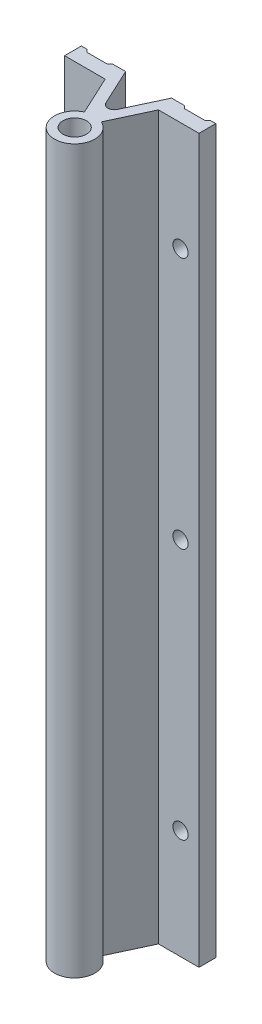
ISO-10303-21;
HEADER;
FILE_DESCRIPTION(('STEP AP214'),'2;1');
FILE_NAME('part.step','',(''),(''),'','','');
FILE_SCHEMA(('AUTOMOTIVE_DESIGN { 1 0 10303 214 1 1 1 1 }'));
ENDSEC;
DATA;
#1=APPLICATION_CONTEXT('core data for automotive mechanical design processes');
#2=APPLICATION_PROTOCOL_DEFINITION('international standard','automotive_design',2000,#1);
#3=PRODUCT_CONTEXT('',#1,'mechanical');
#4=PRODUCT('Part','Part','',(#3));
#5=PRODUCT_RELATED_PRODUCT_CATEGORY('part','',(#4));
#6=PRODUCT_DEFINITION_FORMATION('','',#4);
#7=PRODUCT_DEFINITION_CONTEXT('part definition',#1,'design');
#8=PRODUCT_DEFINITION('design','',#6,#7);
#9=PRODUCT_DEFINITION_SHAPE('','',#8);
#10=(LENGTH_UNIT() NAMED_UNIT(*) SI_UNIT(.MILLI.,.METRE.));
#11=(NAMED_UNIT(*) PLANE_ANGLE_UNIT() SI_UNIT($,.RADIAN.));
#12=(NAMED_UNIT(*) SI_UNIT($,.STERADIAN.) SOLID_ANGLE_UNIT());
#13=UNCERTAINTY_MEASURE_WITH_UNIT(LENGTH_MEASURE(1.E-05),#10,'distance_accuracy_value','');
#14=(GEOMETRIC_REPRESENTATION_CONTEXT(3) GLOBAL_UNCERTAINTY_ASSIGNED_CONTEXT((#13)) GLOBAL_UNIT_ASSIGNED_CONTEXT((#10,
#11,#12)) REPRESENTATION_CONTEXT('',''));
#15=CARTESIAN_POINT('',(0.,0.,0.));
#16=DIRECTION('',(0.,0.,1.));
#17=DIRECTION('',(1.,0.,0.));
#18=AXIS2_PLACEMENT_3D('',#15,#16,#17);
#19=CARTESIAN_POINT('',(-20.,0.,-22.));
#20=DIRECTION('',(0.,0.,-1.));
#21=DIRECTION('',(1.,0.,0.));
#22=AXIS2_PLACEMENT_3D('',#19,#20,#21);
#23=PLANE('',#22);
#24=DIRECTION('',(0.,-1.,0.));
#25=VECTOR('',#24,1.);
#26=CARTESIAN_POINT('',(-20.,-107.5,-22.));
#27=LINE('',#26,#25);
#28=CARTESIAN_POINT('',(-20.,0.,-22.));
#29=VERTEX_POINT('',#28);
#30=CARTESIAN_POINT('',(-20.,-215.,-22.));
#31=VERTEX_POINT('',#30);
#32=EDGE_CURVE('E358',#29,#31,#27,.T.);
#33=ORIENTED_EDGE('',*,*,#32,.F.);
#34=DIRECTION('',(1.,0.,0.));
#35=VECTOR('',#34,1.);
#36=CARTESIAN_POINT('',(-19.175,0.,-22.));
#37=LINE('',#36,#35);
#38=CARTESIAN_POINT('',(-18.35,0.,-22.));
#39=VERTEX_POINT('',#38);
#40=EDGE_CURVE('E291',#29,#39,#37,.T.);
#41=ORIENTED_EDGE('',*,*,#40,.T.);
#42=DIRECTION('',(0.,1.,0.));
#43=VECTOR('',#42,1.);
#44=CARTESIAN_POINT('',(-18.35,-107.5,-22.));
#45=LINE('',#44,#43);
#46=CARTESIAN_POINT('',(-18.35,-215.,-22.));
#47=VERTEX_POINT('',#46);
#48=EDGE_CURVE('E332',#47,#39,#45,.T.);
#49=ORIENTED_EDGE('',*,*,#48,.F.);
#50=DIRECTION('',(-1.,0.,0.));
#51=VECTOR('',#50,1.);
#52=CARTESIAN_POINT('',(-19.175,-215.,-22.));
#53=LINE('',#52,#51);
#54=EDGE_CURVE('E294',#47,#31,#53,.T.);
#55=ORIENTED_EDGE('',*,*,#54,.T.);
#56=EDGE_LOOP('',(#33,#41,#49,#55));
#57=FACE_BOUND('',#56,.T.);
#58=ADVANCED_FACE('F16',(#57),#23,.T.);
#59=CARTESIAN_POINT('',(-18.35,0.,-22.));
#60=DIRECTION('',(0.707106781186546,0.,-0.707106781186549));
#61=DIRECTION('',(0.707106781186549,0.,0.707106781186546));
#62=AXIS2_PLACEMENT_3D('',#59,#60,#61);
#63=PLANE('',#62);
#64=DIRECTION('',(0.707106781186549,0.,0.707106781186546));
#65=VECTOR('',#64,1.);
#66=CARTESIAN_POINT('',(-17.95,0.,-21.6));
#67=LINE('',#66,#65);
#68=CARTESIAN_POINT('',(-17.55,0.,-21.2));
#69=VERTEX_POINT('',#68);
#70=EDGE_CURVE('E289',#39,#69,#67,.T.);
#71=ORIENTED_EDGE('',*,*,#70,.T.);
#72=DIRECTION('',(0.,1.,0.));
#73=VECTOR('',#72,1.);
#74=CARTESIAN_POINT('',(-17.55,-107.5,-21.2));
#75=LINE('',#74,#73);
#76=CARTESIAN_POINT('',(-17.55,-215.,-21.2));
#77=VERTEX_POINT('',#76);
#78=EDGE_CURVE('E323',#77,#69,#75,.T.);
#79=ORIENTED_EDGE('',*,*,#78,.F.);
#80=DIRECTION('',(-0.707106781186549,0.,-0.707106781186546));
#81=VECTOR('',#80,1.);
#82=CARTESIAN_POINT('',(-17.95,-215.,-21.6));
#83=LINE('',#82,#81);
#84=EDGE_CURVE('E293',#77,#47,#83,.T.);
#85=ORIENTED_EDGE('',*,*,#84,.T.);
#86=ORIENTED_EDGE('',*,*,#48,.T.);
#87=EDGE_LOOP('',(#71,#79,#85,#86));
#88=FACE_BOUND('',#87,.T.);
#89=ADVANCED_FACE('F673',(#88),#63,.T.);
#90=CARTESIAN_POINT('',(-14.5,-182.5,-21.2));
#91=DIRECTION('',(0.,0.,1.));
#92=DIRECTION('',(1.,0.,0.));
#93=AXIS2_PLACEMENT_3D('',#90,#91,#92);
#94=CYLINDRICAL_SURFACE('',#93,2.25);
#95=CARTESIAN_POINT('',(-14.5,-182.5,-17.));
#96=DIRECTION('',(0.,0.,1.));
#97=DIRECTION('',(1.,0.,0.));
#98=AXIS2_PLACEMENT_3D('',#95,#96,#97);
#99=CIRCLE('',#98,2.25);
#100=CARTESIAN_POINT('',(-12.25,-182.5,-17.));
#101=VERTEX_POINT('',#100);
#102=EDGE_CURVE('E20',#101,#101,#99,.F.);
#103=ORIENTED_EDGE('',*,*,#102,.F.);
#104=EDGE_LOOP('',(#103));
#105=FACE_BOUND('',#104,.T.);
#106=CARTESIAN_POINT('',(-14.5,-182.5,-21.2));
#107=DIRECTION('',(0.,0.,1.));
#108=DIRECTION('',(1.,0.,0.));
#109=AXIS2_PLACEMENT_3D('',#106,#107,#108);
#110=CIRCLE('',#109,2.25);
#111=CARTESIAN_POINT('',(-12.25,-182.5,-21.2));
#112=VERTEX_POINT('',#111);
#113=EDGE_CURVE('E250',#112,#112,#110,.T.);
#114=ORIENTED_EDGE('',*,*,#113,.F.);
#115=EDGE_LOOP('',(#114));
#116=FACE_BOUND('',#115,.T.);
#117=ADVANCED_FACE('F665',(#105,#116),#94,.F.);
#118=CARTESIAN_POINT('',(-14.5,-107.5,-21.2));
#119=DIRECTION('',(0.,0.,1.));
#120=DIRECTION('',(1.,0.,0.));
#121=AXIS2_PLACEMENT_3D('',#118,#119,#120);
#122=CYLINDRICAL_SURFACE('',#121,2.25);
#123=CARTESIAN_POINT('',(-14.5,-107.5,-17.));
#124=DIRECTION('',(0.,0.,1.));
#125=DIRECTION('',(1.,0.,0.));
#126=AXIS2_PLACEMENT_3D('',#123,#124,#125);
#127=CIRCLE('',#126,2.25);
#128=CARTESIAN_POINT('',(-12.25,-107.5,-17.));
#129=VERTEX_POINT('',#128);
#130=EDGE_CURVE('E257',#129,#129,#127,.F.);
#131=ORIENTED_EDGE('',*,*,#130,.F.);
#132=EDGE_LOOP('',(#131));
#133=FACE_BOUND('',#132,.T.);
#134=CARTESIAN_POINT('',(-14.5,-107.5,-21.2));
#135=DIRECTION('',(0.,0.,1.));
#136=DIRECTION('',(1.,0.,0.));
#137=AXIS2_PLACEMENT_3D('',#134,#135,#136);
#138=CIRCLE('',#137,2.25);
#139=CARTESIAN_POINT('',(-12.25,-107.5,-21.2));
#140=VERTEX_POINT('',#139);
#141=EDGE_CURVE('E247',#140,#140,#138,.T.);
#142=ORIENTED_EDGE('',*,*,#141,.F.);
#143=EDGE_LOOP('',(#142));
#144=FACE_BOUND('',#143,.T.);
#145=ADVANCED_FACE('F657',(#133,#144),#122,.F.);
#146=CARTESIAN_POINT('',(-14.5,-32.5,-21.2));
#147=DIRECTION('',(0.,0.,1.));
#148=DIRECTION('',(1.,0.,0.));
#149=AXIS2_PLACEMENT_3D('',#146,#147,#148);
#150=CYLINDRICAL_SURFACE('',#149,2.25);
#151=CARTESIAN_POINT('',(-14.5,-32.5,-17.));
#152=DIRECTION('',(0.,0.,1.));
#153=DIRECTION('',(1.,0.,0.));
#154=AXIS2_PLACEMENT_3D('',#151,#152,#153);
#155=CIRCLE('',#154,2.25);
#156=CARTESIAN_POINT('',(-12.25,-32.5,-17.));
#157=VERTEX_POINT('',#156);
#158=EDGE_CURVE('E254',#157,#157,#155,.F.);
#159=ORIENTED_EDGE('',*,*,#158,.F.);
#160=EDGE_LOOP('',(#159));
#161=FACE_BOUND('',#160,.T.);
#162=CARTESIAN_POINT('',(-14.5,-32.5,-21.2));
#163=DIRECTION('',(0.,0.,1.));
#164=DIRECTION('',(1.,0.,0.));
#165=AXIS2_PLACEMENT_3D('',#162,#163,#164);
#166=CIRCLE('',#165,2.25);
#167=CARTESIAN_POINT('',(-12.25,-32.5,-21.2));
#168=VERTEX_POINT('',#167);
#169=EDGE_CURVE('E243',#168,#168,#166,.T.);
#170=ORIENTED_EDGE('',*,*,#169,.F.);
#171=EDGE_LOOP('',(#170));
#172=FACE_BOUND('',#171,.T.);
#173=ADVANCED_FACE('F649',(#161,#172),#150,.F.);
#174=CARTESIAN_POINT('',(-11.45,0.,-21.2));
#175=DIRECTION('',(-0.707106781186546,0.,-0.707106781186549));
#176=DIRECTION('',(0.707106781186549,0.,-0.707106781186546));
#177=AXIS2_PLACEMENT_3D('',#174,#175,#176);
#178=PLANE('',#177);
#179=DIRECTION('',(0.707106781186549,0.,-0.707106781186546));
#180=VECTOR('',#179,1.);
#181=CARTESIAN_POINT('',(-11.05,0.,-21.6));
#182=LINE('',#181,#180);
#183=CARTESIAN_POINT('',(-11.45,0.,-21.2));
#184=VERTEX_POINT('',#183);
#185=CARTESIAN_POINT('',(-10.65,0.,-22.));
#186=VERTEX_POINT('',#185);
#187=EDGE_CURVE('E286',#184,#186,#182,.T.);
#188=ORIENTED_EDGE('',*,*,#187,.T.);
#189=DIRECTION('',(0.,1.,0.));
#190=VECTOR('',#189,1.);
#191=CARTESIAN_POINT('',(-10.65,-107.5,-22.));
#192=LINE('',#191,#190);
#193=CARTESIAN_POINT('',(-10.65,-215.,-22.));
#194=VERTEX_POINT('',#193);
#195=EDGE_CURVE('E246',#194,#186,#192,.T.);
#196=ORIENTED_EDGE('',*,*,#195,.F.);
#197=DIRECTION('',(-0.707106781186549,0.,0.707106781186546));
#198=VECTOR('',#197,1.);
#199=CARTESIAN_POINT('',(-11.05,-215.,-21.6));
#200=LINE('',#199,#198);
#201=CARTESIAN_POINT('',(-11.45,-215.,-21.2));
#202=VERTEX_POINT('',#201);
#203=EDGE_CURVE('E287',#194,#202,#200,.T.);
#204=ORIENTED_EDGE('',*,*,#203,.T.);
#205=DIRECTION('',(0.,-1.,0.));
#206=VECTOR('',#205,1.);
#207=CARTESIAN_POINT('',(-11.45,-107.5,-21.2));
#208=LINE('',#207,#206);
#209=EDGE_CURVE('E253',#184,#202,#208,.T.);
#210=ORIENTED_EDGE('',*,*,#209,.F.);
#211=EDGE_LOOP('',(#188,#196,#204,#210));
#212=FACE_BOUND('',#211,.T.);
#213=ADVANCED_FACE('F641',(#212),#178,.T.);
#214=CARTESIAN_POINT('',(10.65,0.,-22.));
#215=DIRECTION('',(0.707106781186546,0.,-0.707106781186549));
#216=DIRECTION('',(0.707106781186549,0.,0.707106781186546));
#217=AXIS2_PLACEMENT_3D('',#214,#215,#216);
#218=PLANE('',#217);
#219=DIRECTION('',(0.707106781186549,0.,0.707106781186546));
#220=VECTOR('',#219,1.);
#221=CARTESIAN_POINT('',(11.05,0.,-21.6));
#222=LINE('',#221,#220);
#223=CARTESIAN_POINT('',(10.65,0.,-22.));
#224=VERTEX_POINT('',#223);
#225=CARTESIAN_POINT('',(11.45,0.,-21.2));
#226=VERTEX_POINT('',#225);
#227=EDGE_CURVE('E280',#224,#226,#222,.T.);
#228=ORIENTED_EDGE('',*,*,#227,.T.);
#229=DIRECTION('',(0.,1.,0.));
#230=VECTOR('',#229,1.);
#231=CARTESIAN_POINT('',(11.45,-107.5,-21.2));
#232=LINE('',#231,#230);
#233=CARTESIAN_POINT('',(11.45,-215.,-21.2));
#234=VERTEX_POINT('',#233);
#235=EDGE_CURVE('E307',#234,#226,#232,.T.);
#236=ORIENTED_EDGE('',*,*,#235,.F.);
#237=DIRECTION('',(-0.707106781186549,0.,-0.707106781186546));
#238=VECTOR('',#237,1.);
#239=CARTESIAN_POINT('',(11.05,-215.,-21.6));
#240=LINE('',#239,#238);
#241=CARTESIAN_POINT('',(10.65,-215.,-22.));
#242=VERTEX_POINT('',#241);
#243=EDGE_CURVE('E284',#234,#242,#240,.T.);
#244=ORIENTED_EDGE('',*,*,#243,.T.);
#245=DIRECTION('',(0.,-1.,0.));
#246=VECTOR('',#245,1.);
#247=CARTESIAN_POINT('',(10.65,-107.5,-22.));
#248=LINE('',#247,#246);
#249=EDGE_CURVE('E351',#224,#242,#248,.T.);
#250=ORIENTED_EDGE('',*,*,#249,.F.);
#251=EDGE_LOOP('',(#228,#236,#244,#250));
#252=FACE_BOUND('',#251,.T.);
#253=ADVANCED_FACE('F634',(#252),#218,.T.);
#254=CARTESIAN_POINT('',(17.55,0.,-21.2));
#255=DIRECTION('',(-0.707106781186546,0.,-0.707106781186549));
#256=DIRECTION('',(0.707106781186549,0.,-0.707106781186546));
#257=AXIS2_PLACEMENT_3D('',#254,#255,#256);
#258=PLANE('',#257);
#259=DIRECTION('',(0.707106781186549,0.,-0.707106781186546));
#260=VECTOR('',#259,1.);
#261=CARTESIAN_POINT('',(17.95,0.,-21.6));
#262=LINE('',#261,#260);
#263=CARTESIAN_POINT('',(17.55,0.,-21.2));
#264=VERTEX_POINT('',#263);
#265=CARTESIAN_POINT('',(18.35,0.,-22.));
#266=VERTEX_POINT('',#265);
#267=EDGE_CURVE('E90',#264,#266,#262,.T.);
#268=ORIENTED_EDGE('',*,*,#267,.T.);
#269=DIRECTION('',(0.,1.,0.));
#270=VECTOR('',#269,1.);
#271=CARTESIAN_POINT('',(18.35,-107.5,-22.));
#272=LINE('',#271,#270);
#273=CARTESIAN_POINT('',(18.35,-215.,-22.));
#274=VERTEX_POINT('',#273);
#275=EDGE_CURVE('E274',#274,#266,#272,.T.);
#276=ORIENTED_EDGE('',*,*,#275,.F.);
#277=DIRECTION('',(-0.707106781186549,0.,0.707106781186546));
#278=VECTOR('',#277,1.);
#279=CARTESIAN_POINT('',(17.95,-215.,-21.6));
#280=LINE('',#279,#278);
#281=CARTESIAN_POINT('',(17.55,-215.,-21.2));
#282=VERTEX_POINT('',#281);
#283=EDGE_CURVE('E283',#274,#282,#280,.T.);
#284=ORIENTED_EDGE('',*,*,#283,.T.);
#285=DIRECTION('',(0.,-1.,0.));
#286=VECTOR('',#285,1.);
#287=CARTESIAN_POINT('',(17.55,-107.5,-21.2));
#288=LINE('',#287,#286);
#289=EDGE_CURVE('E242',#264,#282,#288,.T.);
#290=ORIENTED_EDGE('',*,*,#289,.F.);
#291=EDGE_LOOP('',(#268,#276,#284,#290));
#292=FACE_BOUND('',#291,.T.);
#293=ADVANCED_FACE('F627',(#292),#258,.T.);
#294=CARTESIAN_POINT('',(18.35,0.,-22.));
#295=DIRECTION('',(0.,0.,-1.));
#296=DIRECTION('',(1.,0.,0.));
#297=AXIS2_PLACEMENT_3D('',#294,#295,#296);
#298=PLANE('',#297);
#299=DIRECTION('',(0.,1.,0.));
#300=VECTOR('',#299,1.);
#301=CARTESIAN_POINT('',(20.,-107.5,-22.));
#302=LINE('',#301,#300);
#303=CARTESIAN_POINT('',(20.,-215.,-22.));
#304=VERTEX_POINT('',#303);
#305=CARTESIAN_POINT('',(20.,0.,-22.));
#306=VERTEX_POINT('',#305);
#307=EDGE_CURVE('E235',#304,#306,#302,.T.);
#308=ORIENTED_EDGE('',*,*,#307,.F.);
#309=DIRECTION('',(-1.,0.,0.));
#310=VECTOR('',#309,1.);
#311=CARTESIAN_POINT('',(19.175,-215.,-22.));
#312=LINE('',#311,#310);
#313=EDGE_CURVE('E262',#304,#274,#312,.T.);
#314=ORIENTED_EDGE('',*,*,#313,.T.);
#315=ORIENTED_EDGE('',*,*,#275,.T.);
#316=DIRECTION('',(1.,0.,0.));
#317=VECTOR('',#316,1.);
#318=CARTESIAN_POINT('',(19.175,0.,-22.));
#319=LINE('',#318,#317);
#320=EDGE_CURVE('E266',#266,#306,#319,.T.);
#321=ORIENTED_EDGE('',*,*,#320,.T.);
#322=EDGE_LOOP('',(#308,#314,#315,#321));
#323=FACE_BOUND('',#322,.T.);
#324=ADVANCED_FACE('F403',(#323),#298,.T.);
#325=CARTESIAN_POINT('',(14.5,-182.5,-21.2));
#326=DIRECTION('',(0.,0.,1.));
#327=DIRECTION('',(1.,0.,0.));
#328=AXIS2_PLACEMENT_3D('',#325,#326,#327);
#329=CYLINDRICAL_SURFACE('',#328,2.25);
#330=CARTESIAN_POINT('',(14.5,-182.5,-17.));
#331=DIRECTION('',(0.,0.,1.));
#332=DIRECTION('',(1.,0.,0.));
#333=AXIS2_PLACEMENT_3D('',#330,#331,#332);
#334=CIRCLE('',#333,2.25);
#335=CARTESIAN_POINT('',(16.75,-182.5,-17.));
#336=VERTEX_POINT('',#335);
#337=EDGE_CURVE('E227',#336,#336,#334,.F.);
#338=ORIENTED_EDGE('',*,*,#337,.F.);
#339=EDGE_LOOP('',(#338));
#340=FACE_BOUND('',#339,.T.);
#341=CARTESIAN_POINT('',(14.5,-182.5,-21.2));
#342=DIRECTION('',(0.,0.,1.));
#343=DIRECTION('',(1.,0.,0.));
#344=AXIS2_PLACEMENT_3D('',#341,#342,#343);
#345=CIRCLE('',#344,2.25);
#346=CARTESIAN_POINT('',(16.75,-182.5,-21.2));
#347=VERTEX_POINT('',#346);
#348=EDGE_CURVE('E239',#347,#347,#345,.T.);
#349=ORIENTED_EDGE('',*,*,#348,.F.);
#350=EDGE_LOOP('',(#349));
#351=FACE_BOUND('',#350,.T.);
#352=ADVANCED_FACE('F612',(#340,#351),#329,.F.);
#353=CARTESIAN_POINT('',(14.5,-107.5,-21.2));
#354=DIRECTION('',(0.,0.,1.));
#355=DIRECTION('',(1.,0.,0.));
#356=AXIS2_PLACEMENT_3D('',#353,#354,#355);
#357=CYLINDRICAL_SURFACE('',#356,2.25);
#358=CARTESIAN_POINT('',(14.5,-107.5,-17.));
#359=DIRECTION('',(0.,0.,1.));
#360=DIRECTION('',(1.,0.,0.));
#361=AXIS2_PLACEMENT_3D('',#358,#359,#360);
#362=CIRCLE('',#361,2.25);
#363=CARTESIAN_POINT('',(16.75,-107.5,-17.));
#364=VERTEX_POINT('',#363);
#365=EDGE_CURVE('E224',#364,#364,#362,.F.);
#366=ORIENTED_EDGE('',*,*,#365,.F.);
#367=EDGE_LOOP('',(#366));
#368=FACE_BOUND('',#367,.T.);
#369=CARTESIAN_POINT('',(14.5,-107.5,-21.2));
#370=DIRECTION('',(0.,0.,1.));
#371=DIRECTION('',(1.,0.,0.));
#372=AXIS2_PLACEMENT_3D('',#369,#370,#371);
#373=CIRCLE('',#372,2.25);
#374=CARTESIAN_POINT('',(16.75,-107.5,-21.2));
#375=VERTEX_POINT('',#374);
#376=EDGE_CURVE('E236',#375,#375,#373,.T.);
#377=ORIENTED_EDGE('',*,*,#376,.F.);
#378=EDGE_LOOP('',(#377));
#379=FACE_BOUND('',#378,.T.);
#380=ADVANCED_FACE('F604',(#368,#379),#357,.F.);
#381=CARTESIAN_POINT('',(14.5,-32.5,-21.2));
#382=DIRECTION('',(0.,0.,1.));
#383=DIRECTION('',(1.,0.,0.));
#384=AXIS2_PLACEMENT_3D('',#381,#382,#383);
#385=CYLINDRICAL_SURFACE('',#384,2.25);
#386=CARTESIAN_POINT('',(14.5,-32.5,-17.));
#387=DIRECTION('',(0.,0.,1.));
#388=DIRECTION('',(1.,0.,0.));
#389=AXIS2_PLACEMENT_3D('',#386,#387,#388);
#390=CIRCLE('',#389,2.25);
#391=CARTESIAN_POINT('',(16.75,-32.5,-17.));
#392=VERTEX_POINT('',#391);
#393=EDGE_CURVE('E219',#392,#392,#390,.F.);
#394=ORIENTED_EDGE('',*,*,#393,.F.);
#395=EDGE_LOOP('',(#394));
#396=FACE_BOUND('',#395,.T.);
#397=CARTESIAN_POINT('',(14.5,-32.5,-21.2));
#398=DIRECTION('',(0.,0.,1.));
#399=DIRECTION('',(1.,0.,0.));
#400=AXIS2_PLACEMENT_3D('',#397,#398,#399);
#401=CIRCLE('',#400,2.25);
#402=CARTESIAN_POINT('',(16.75,-32.5,-21.2));
#403=VERTEX_POINT('',#402);
#404=EDGE_CURVE('E231',#403,#403,#401,.T.);
#405=ORIENTED_EDGE('',*,*,#404,.F.);
#406=EDGE_LOOP('',(#405));
#407=FACE_BOUND('',#406,.T.);
#408=ADVANCED_FACE('F596',(#396,#407),#385,.F.);
#409=CARTESIAN_POINT('',(-7.92723018863498,0.,-17.));
#410=DIRECTION('',(0.,0.,1.));
#411=DIRECTION('',(-1.,0.,0.));
#412=AXIS2_PLACEMENT_3D('',#409,#410,#411);
#413=PLANE('',#412);
#414=ORIENTED_EDGE('',*,*,#158,.T.);
#415=EDGE_LOOP('',(#414));
#416=FACE_BOUND('',#415,.T.);
#417=ORIENTED_EDGE('',*,*,#130,.T.);
#418=EDGE_LOOP('',(#417));
#419=FACE_BOUND('',#418,.T.);
#420=ORIENTED_EDGE('',*,*,#102,.T.);
#421=EDGE_LOOP('',(#420));
#422=FACE_BOUND('',#421,.T.);
#423=DIRECTION('',(1.,0.,0.));
#424=VECTOR('',#423,1.);
#425=CARTESIAN_POINT('',(0.,0.,-17.));
#426=LINE('',#425,#424);
#427=CARTESIAN_POINT('',(-20.,0.,-17.));
#428=VERTEX_POINT('',#427);
#429=CARTESIAN_POINT('',(-7.92723018863498,0.,-17.));
#430=VERTEX_POINT('',#429);
#431=EDGE_CURVE('E202',#428,#430,#426,.T.);
#432=ORIENTED_EDGE('',*,*,#431,.F.);
#433=DIRECTION('',(0.,1.,0.));
#434=VECTOR('',#433,1.);
#435=CARTESIAN_POINT('',(-20.,-107.5,-17.));
#436=LINE('',#435,#434);
#437=CARTESIAN_POINT('',(-20.,-215.,-17.));
#438=VERTEX_POINT('',#437);
#439=EDGE_CURVE('E256',#438,#428,#436,.T.);
#440=ORIENTED_EDGE('',*,*,#439,.F.);
#441=DIRECTION('',(-1.,0.,0.));
#442=VECTOR('',#441,1.);
#443=CARTESIAN_POINT('',(0.,-215.,-17.));
#444=LINE('',#443,#442);
#445=CARTESIAN_POINT('',(-7.92723018863498,-215.,-17.));
#446=VERTEX_POINT('',#445);
#447=EDGE_CURVE('E195',#446,#438,#444,.T.);
#448=ORIENTED_EDGE('',*,*,#447,.F.);
#449=DIRECTION('',(0.,-1.,0.));
#450=VECTOR('',#449,1.);
#451=CARTESIAN_POINT('',(-7.92723018863498,-107.5,-17.));
#452=LINE('',#451,#450);
#453=EDGE_CURVE('E196',#430,#446,#452,.T.);
#454=ORIENTED_EDGE('',*,*,#453,.F.);
#455=EDGE_LOOP('',(#432,#440,#448,#454));
#456=FACE_BOUND('',#455,.T.);
#457=ADVANCED_FACE('F428',(#416,#419,#422,#456),#413,.T.);
#458=CARTESIAN_POINT('',(-20.,0.,-17.));
#459=DIRECTION('',(-1.,0.,0.));
#460=DIRECTION('',(0.,0.,-1.));
#461=AXIS2_PLACEMENT_3D('',#458,#459,#460);
#462=PLANE('',#461);
#463=DIRECTION('',(0.,0.,1.));
#464=VECTOR('',#463,1.);
#465=CARTESIAN_POINT('',(-20.,0.,-8.));
#466=LINE('',#465,#464);
#467=EDGE_CURVE('E327',#29,#428,#466,.T.);
#468=ORIENTED_EDGE('',*,*,#467,.F.);
#469=ORIENTED_EDGE('',*,*,#32,.T.);
#470=DIRECTION('',(0.,0.,-1.));
#471=VECTOR('',#470,1.);
#472=CARTESIAN_POINT('',(-20.,-215.,-8.));
#473=LINE('',#472,#471);
#474=EDGE_CURVE('E296',#438,#31,#473,.T.);
#475=ORIENTED_EDGE('',*,*,#474,.F.);
#476=ORIENTED_EDGE('',*,*,#439,.T.);
#477=EDGE_LOOP('',(#468,#469,#475,#476));
#478=FACE_BOUND('',#477,.T.);
#479=ADVANCED_FACE('F581',(#478),#462,.T.);
#480=CARTESIAN_POINT('',(-17.55,0.,-21.2));
#481=DIRECTION('',(0.,0.,-1.));
#482=DIRECTION('',(1.,0.,0.));
#483=AXIS2_PLACEMENT_3D('',#480,#481,#482);
#484=PLANE('',#483);
#485=ORIENTED_EDGE('',*,*,#169,.T.);
#486=EDGE_LOOP('',(#485));
#487=FACE_BOUND('',#486,.T.);
#488=ORIENTED_EDGE('',*,*,#141,.T.);
#489=EDGE_LOOP('',(#488));
#490=FACE_BOUND('',#489,.T.);
#491=ORIENTED_EDGE('',*,*,#113,.T.);
#492=EDGE_LOOP('',(#491));
#493=FACE_BOUND('',#492,.T.);
#494=DIRECTION('',(-1.,0.,0.));
#495=VECTOR('',#494,1.);
#496=CARTESIAN_POINT('',(0.,0.,-21.2));
#497=LINE('',#496,#495);
#498=EDGE_CURVE('E324',#184,#69,#497,.T.);
#499=ORIENTED_EDGE('',*,*,#498,.F.);
#500=ORIENTED_EDGE('',*,*,#209,.T.);
#501=DIRECTION('',(1.,0.,0.));
#502=VECTOR('',#501,1.);
#503=CARTESIAN_POINT('',(0.,-215.,-21.2));
#504=LINE('',#503,#502);
#505=EDGE_CURVE('E189',#77,#202,#504,.T.);
#506=ORIENTED_EDGE('',*,*,#505,.F.);
#507=ORIENTED_EDGE('',*,*,#78,.T.);
#508=EDGE_LOOP('',(#499,#500,#506,#507));
#509=FACE_BOUND('',#508,.T.);
#510=ADVANCED_FACE('F574',(#487,#490,#493,#509),#484,.T.);
#511=CARTESIAN_POINT('',(-10.65,0.,-22.));
#512=DIRECTION('',(0.,0.,-1.));
#513=DIRECTION('',(1.,0.,0.));
#514=AXIS2_PLACEMENT_3D('',#511,#512,#513);
#515=PLANE('',#514);
#516=DIRECTION('',(0.,1.,0.));
#517=VECTOR('',#516,1.);
#518=CARTESIAN_POINT('',(-6.83917898627332,-107.5,-22.));
#519=LINE('',#518,#517);
#520=CARTESIAN_POINT('',(-6.83917898627332,-215.,-22.));
#521=VERTEX_POINT('',#520);
#522=CARTESIAN_POINT('',(-6.83917898627332,0.,-22.));
#523=VERTEX_POINT('',#522);
#524=EDGE_CURVE('E158',#521,#523,#519,.T.);
#525=ORIENTED_EDGE('',*,*,#524,.F.);
#526=DIRECTION('',(1.,0.,0.));
#527=VECTOR('',#526,1.);
#528=CARTESIAN_POINT('',(0.,-215.,-22.));
#529=LINE('',#528,#527);
#530=EDGE_CURVE('E187',#194,#521,#529,.T.);
#531=ORIENTED_EDGE('',*,*,#530,.F.);
#532=ORIENTED_EDGE('',*,*,#195,.T.);
#533=DIRECTION('',(-1.,0.,0.));
#534=VECTOR('',#533,1.);
#535=CARTESIAN_POINT('',(0.,0.,-22.));
#536=LINE('',#535,#534);
#537=EDGE_CURVE('E205',#523,#186,#536,.T.);
#538=ORIENTED_EDGE('',*,*,#537,.F.);
#539=EDGE_LOOP('',(#525,#531,#532,#538));
#540=FACE_BOUND('',#539,.T.);
#541=ADVANCED_FACE('F564',(#540),#515,.T.);
#542=CARTESIAN_POINT('',(-6.83917898627332,0.,-22.));
#543=DIRECTION('',(0.90630778703665,0.,-0.4226182617407));
#544=DIRECTION('',(0.4226182617407,0.,0.90630778703665));
#545=AXIS2_PLACEMENT_3D('',#542,#543,#544);
#546=PLANE('',#545);
#547=DIRECTION('',(-0.422618261740699,0.,-0.90630778703665));
#548=VECTOR('',#547,1.);
#549=CARTESIAN_POINT('',(-1.70979474656834,0.,-11.));
#550=LINE('',#549,#548);
#551=CARTESIAN_POINT('',(-1.70979474656833,0.,-11.));
#552=VERTEX_POINT('',#551);
#553=EDGE_CURVE('E170',#552,#523,#550,.T.);
#554=ORIENTED_EDGE('',*,*,#553,.F.);
#555=DIRECTION('',(0.,1.,0.));
#556=VECTOR('',#555,1.);
#557=CARTESIAN_POINT('',(-1.70979474656833,-107.5,-11.));
#558=LINE('',#557,#556);
#559=CARTESIAN_POINT('',(-1.70979474656833,-215.,-11.));
#560=VERTEX_POINT('',#559);
#561=EDGE_CURVE('E163',#560,#552,#558,.T.);
#562=ORIENTED_EDGE('',*,*,#561,.F.);
#563=DIRECTION('',(0.422618261740699,0.,0.90630778703665));
#564=VECTOR('',#563,1.);
#565=CARTESIAN_POINT('',(-6.83917898627331,-215.,-22.));
#566=LINE('',#565,#564);
#567=EDGE_CURVE('E167',#521,#560,#566,.T.);
#568=ORIENTED_EDGE('',*,*,#567,.F.);
#569=ORIENTED_EDGE('',*,*,#524,.T.);
#570=EDGE_LOOP('',(#554,#562,#568,#569));
#571=FACE_BOUND('',#570,.T.);
#572=ADVANCED_FACE('F165',(#571),#546,.T.);
#573=CARTESIAN_POINT('',(0.,0.,-11.797290384198));
#574=DIRECTION('',(0.,-1.,0.));
#575=DIRECTION('',(0.,0.,-1.));
#576=AXIS2_PLACEMENT_3D('',#573,#574,#575);
#577=CYLINDRICAL_SURFACE('',#576,1.88654976932156);
#578=CARTESIAN_POINT('',(0.,0.,-11.797290384198));
#579=DIRECTION('',(0.,-1.,0.));
#580=DIRECTION('',(0.,0.,-1.));
#581=AXIS2_PLACEMENT_3D('',#578,#579,#580);
#582=CIRCLE('',#581,1.88654976932156);
#583=CARTESIAN_POINT('',(1.70979474656833,0.,-11.));
#584=VERTEX_POINT('',#583);
#585=EDGE_CURVE('E206',#584,#552,#582,.T.);
#586=ORIENTED_EDGE('',*,*,#585,.F.);
#587=DIRECTION('',(0.,1.,0.));
#588=VECTOR('',#587,1.);
#589=CARTESIAN_POINT('',(1.70979474656833,-107.5,-11.));
#590=LINE('',#589,#588);
#591=CARTESIAN_POINT('',(1.70979474656833,-215.,-11.));
#592=VERTEX_POINT('',#591);
#593=EDGE_CURVE('E175',#592,#584,#590,.T.);
#594=ORIENTED_EDGE('',*,*,#593,.F.);
#595=CARTESIAN_POINT('',(0.,-215.,-11.797290384198));
#596=DIRECTION('',(0.,-1.,0.));
#597=DIRECTION('',(0.,0.,-1.));
#598=AXIS2_PLACEMENT_3D('',#595,#596,#597);
#599=CIRCLE('',#598,1.88654976932156);
#600=EDGE_CURVE('E178',#560,#592,#599,.F.);
#601=ORIENTED_EDGE('',*,*,#600,.F.);
#602=ORIENTED_EDGE('',*,*,#561,.T.);
#603=EDGE_LOOP('',(#586,#594,#601,#602));
#604=FACE_BOUND('',#603,.T.);
#605=ADVANCED_FACE('F179',(#604),#577,.F.);
#606=CARTESIAN_POINT('',(1.70979474656833,0.,-11.));
#607=DIRECTION('',(-0.90630778703665,0.,-0.4226182617407));
#608=DIRECTION('',(0.4226182617407,0.,-0.90630778703665));
#609=AXIS2_PLACEMENT_3D('',#606,#607,#608);
#610=PLANE('',#609);
#611=DIRECTION('',(-0.4226182617407,0.,0.90630778703665));
#612=VECTOR('',#611,1.);
#613=CARTESIAN_POINT('',(6.83917898627331,0.,-22.));
#614=LINE('',#613,#612);
#615=CARTESIAN_POINT('',(6.83917898627331,0.,-22.));
#616=VERTEX_POINT('',#615);
#617=EDGE_CURVE('E209',#616,#584,#614,.T.);
#618=ORIENTED_EDGE('',*,*,#617,.F.);
#619=DIRECTION('',(0.,1.,0.));
#620=VECTOR('',#619,1.);
#621=CARTESIAN_POINT('',(6.83917898627331,-107.5,-22.));
#622=LINE('',#621,#620);
#623=CARTESIAN_POINT('',(6.83917898627331,-215.,-22.));
#624=VERTEX_POINT('',#623);
#625=EDGE_CURVE('E320',#624,#616,#622,.T.);
#626=ORIENTED_EDGE('',*,*,#625,.F.);
#627=DIRECTION('',(0.4226182617407,0.,-0.90630778703665));
#628=VECTOR('',#627,1.);
#629=CARTESIAN_POINT('',(1.70979474656833,-215.,-11.));
#630=LINE('',#629,#628);
#631=EDGE_CURVE('E183',#592,#624,#630,.T.);
#632=ORIENTED_EDGE('',*,*,#631,.F.);
#633=ORIENTED_EDGE('',*,*,#593,.T.);
#634=EDGE_LOOP('',(#618,#626,#632,#633));
#635=FACE_BOUND('',#634,.T.);
#636=ADVANCED_FACE('F522',(#635),#610,.T.);
#637=CARTESIAN_POINT('',(6.83917898627331,0.,-22.));
#638=DIRECTION('',(0.,0.,-1.));
#639=DIRECTION('',(1.,0.,0.));
#640=AXIS2_PLACEMENT_3D('',#637,#638,#639);
#641=PLANE('',#640);
#642=ORIENTED_EDGE('',*,*,#625,.T.);
#643=DIRECTION('',(-1.,0.,0.));
#644=VECTOR('',#643,1.);
#645=CARTESIAN_POINT('',(0.,0.,-22.));
#646=LINE('',#645,#644);
#647=EDGE_CURVE('E213',#224,#616,#646,.T.);
#648=ORIENTED_EDGE('',*,*,#647,.F.);
#649=ORIENTED_EDGE('',*,*,#249,.T.);
#650=DIRECTION('',(1.,0.,0.));
#651=VECTOR('',#650,1.);
#652=CARTESIAN_POINT('',(0.,-215.,-22.));
#653=LINE('',#652,#651);
#654=EDGE_CURVE('E316',#624,#242,#653,.T.);
#655=ORIENTED_EDGE('',*,*,#654,.F.);
#656=EDGE_LOOP('',(#642,#648,#649,#655));
#657=FACE_BOUND('',#656,.T.);
#658=ADVANCED_FACE('F532',(#657),#641,.T.);
#659=CARTESIAN_POINT('',(11.45,0.,-21.2));
#660=DIRECTION('',(0.,0.,-1.));
#661=DIRECTION('',(1.,0.,0.));
#662=AXIS2_PLACEMENT_3D('',#659,#660,#661);
#663=PLANE('',#662);
#664=ORIENTED_EDGE('',*,*,#404,.T.);
#665=EDGE_LOOP('',(#664));
#666=FACE_BOUND('',#665,.T.);
#667=ORIENTED_EDGE('',*,*,#376,.T.);
#668=EDGE_LOOP('',(#667));
#669=FACE_BOUND('',#668,.T.);
#670=ORIENTED_EDGE('',*,*,#348,.T.);
#671=EDGE_LOOP('',(#670));
#672=FACE_BOUND('',#671,.T.);
#673=DIRECTION('',(-1.,0.,0.));
#674=VECTOR('',#673,1.);
#675=CARTESIAN_POINT('',(0.,0.,-21.2));
#676=LINE('',#675,#674);
#677=EDGE_CURVE('E308',#264,#226,#676,.T.);
#678=ORIENTED_EDGE('',*,*,#677,.F.);
#679=ORIENTED_EDGE('',*,*,#289,.T.);
#680=DIRECTION('',(1.,0.,0.));
#681=VECTOR('',#680,1.);
#682=CARTESIAN_POINT('',(0.,-215.,-21.2));
#683=LINE('',#682,#681);
#684=EDGE_CURVE('E312',#234,#282,#683,.T.);
#685=ORIENTED_EDGE('',*,*,#684,.F.);
#686=ORIENTED_EDGE('',*,*,#235,.T.);
#687=EDGE_LOOP('',(#678,#679,#685,#686));
#688=FACE_BOUND('',#687,.T.);
#689=ADVANCED_FACE('F444',(#666,#669,#672,#688),#663,.T.);
#690=CARTESIAN_POINT('',(20.,0.,-22.));
#691=DIRECTION('',(1.,0.,0.));
#692=DIRECTION('',(0.,0.,1.));
#693=AXIS2_PLACEMENT_3D('',#690,#691,#692);
#694=PLANE('',#693);
#695=DIRECTION('',(0.,0.,-1.));
#696=VECTOR('',#695,1.);
#697=CARTESIAN_POINT('',(20.,0.,-8.));
#698=LINE('',#697,#696);
#699=CARTESIAN_POINT('',(20.,0.,-17.));
#700=VERTEX_POINT('',#699);
#701=EDGE_CURVE('E277',#700,#306,#698,.T.);
#702=ORIENTED_EDGE('',*,*,#701,.F.);
#703=DIRECTION('',(0.,1.,0.));
#704=VECTOR('',#703,1.);
#705=CARTESIAN_POINT('',(20.,-107.5,-17.));
#706=LINE('',#705,#704);
#707=CARTESIAN_POINT('',(20.,-215.,-17.));
#708=VERTEX_POINT('',#707);
#709=EDGE_CURVE('E230',#708,#700,#706,.T.);
#710=ORIENTED_EDGE('',*,*,#709,.F.);
#711=DIRECTION('',(0.,0.,1.));
#712=VECTOR('',#711,1.);
#713=CARTESIAN_POINT('',(20.,-215.,-8.));
#714=LINE('',#713,#712);
#715=EDGE_CURVE('E315',#304,#708,#714,.T.);
#716=ORIENTED_EDGE('',*,*,#715,.F.);
#717=ORIENTED_EDGE('',*,*,#307,.T.);
#718=EDGE_LOOP('',(#702,#710,#716,#717));
#719=FACE_BOUND('',#718,.T.);
#720=ADVANCED_FACE('F388',(#719),#694,.T.);
#721=CARTESIAN_POINT('',(20.,0.,-17.));
#722=DIRECTION('',(0.,0.,1.));
#723=DIRECTION('',(-1.,0.,0.));
#724=AXIS2_PLACEMENT_3D('',#721,#722,#723);
#725=PLANE('',#724);
#726=ORIENTED_EDGE('',*,*,#393,.T.);
#727=EDGE_LOOP('',(#726));
#728=FACE_BOUND('',#727,.T.);
#729=ORIENTED_EDGE('',*,*,#365,.T.);
#730=EDGE_LOOP('',(#729));
#731=FACE_BOUND('',#730,.T.);
#732=ORIENTED_EDGE('',*,*,#337,.T.);
#733=EDGE_LOOP('',(#732));
#734=FACE_BOUND('',#733,.T.);
#735=DIRECTION('',(1.,0.,0.));
#736=VECTOR('',#735,1.);
#737=CARTESIAN_POINT('',(0.,0.,-17.));
#738=LINE('',#737,#736);
#739=CARTESIAN_POINT('',(7.92723018863498,0.,-17.));
#740=VERTEX_POINT('',#739);
#741=EDGE_CURVE('E217',#740,#700,#738,.T.);
#742=ORIENTED_EDGE('',*,*,#741,.F.);
#743=DIRECTION('',(0.,1.,0.));
#744=VECTOR('',#743,1.);
#745=CARTESIAN_POINT('',(7.92723018863498,-107.5,-17.));
#746=LINE('',#745,#744);
#747=CARTESIAN_POINT('',(7.92723018863498,-215.,-17.));
#748=VERTEX_POINT('',#747);
#749=EDGE_CURVE('E223',#748,#740,#746,.T.);
#750=ORIENTED_EDGE('',*,*,#749,.F.);
#751=DIRECTION('',(-1.,0.,0.));
#752=VECTOR('',#751,1.);
#753=CARTESIAN_POINT('',(0.,-215.,-17.));
#754=LINE('',#753,#752);
#755=EDGE_CURVE('E343',#708,#748,#754,.T.);
#756=ORIENTED_EDGE('',*,*,#755,.F.);
#757=ORIENTED_EDGE('',*,*,#709,.T.);
#758=EDGE_LOOP('',(#742,#750,#756,#757));
#759=FACE_BOUND('',#758,.T.);
#760=ADVANCED_FACE('F433',(#728,#731,#734,#759),#725,.T.);
#761=CARTESIAN_POINT('',(7.92723018863498,0.,-17.));
#762=DIRECTION('',(0.90630778703665,0.,0.4226182617407));
#763=DIRECTION('',(-0.4226182617407,0.,0.90630778703665));
#764=AXIS2_PLACEMENT_3D('',#761,#762,#763);
#765=PLANE('',#764);
#766=ORIENTED_EDGE('',*,*,#749,.T.);
#767=DIRECTION('',(0.4226182617407,0.,-0.90630778703665));
#768=VECTOR('',#767,1.);
#769=CARTESIAN_POINT('',(2.53570957044419,0.,-5.4378467222199));
#770=LINE('',#769,#768);
#771=CARTESIAN_POINT('',(2.5357095704442,0.,-5.4378467222199));
#772=VERTEX_POINT('',#771);
#773=EDGE_CURVE('E214',#772,#740,#770,.T.);
#774=ORIENTED_EDGE('',*,*,#773,.F.);
#775=DIRECTION('',(0.,1.,0.));
#776=VECTOR('',#775,1.);
#777=CARTESIAN_POINT('',(2.5357095704442,-107.5,-5.4378467222199));
#778=LINE('',#777,#776);
#779=CARTESIAN_POINT('',(2.5357095704442,-215.,-5.4378467222199));
#780=VERTEX_POINT('',#779);
#781=EDGE_CURVE('E218',#780,#772,#778,.T.);
#782=ORIENTED_EDGE('',*,*,#781,.F.);
#783=DIRECTION('',(-0.4226182617407,0.,0.90630778703665));
#784=VECTOR('',#783,1.);
#785=CARTESIAN_POINT('',(7.92723018863498,-215.,-17.));
#786=LINE('',#785,#784);
#787=EDGE_CURVE('E342',#748,#780,#786,.T.);
#788=ORIENTED_EDGE('',*,*,#787,.F.);
#789=EDGE_LOOP('',(#766,#774,#782,#788));
#790=FACE_BOUND('',#789,.T.);
#791=ADVANCED_FACE('F432',(#790),#765,.T.);
#792=CARTESIAN_POINT('',(0.,-215.,0.));
#793=DIRECTION('',(0.,1.,0.));
#794=DIRECTION('',(0.,0.,1.));
#795=AXIS2_PLACEMENT_3D('',#792,#793,#794);
#796=CYLINDRICAL_SURFACE('',#795,3.5);
#797=CARTESIAN_POINT('',(0.,-215.,0.));
#798=DIRECTION('',(0.,1.,0.));
#799=DIRECTION('',(0.,0.,1.));
#800=AXIS2_PLACEMENT_3D('',#797,#798,#799);
#801=CIRCLE('',#800,3.5);
#802=CARTESIAN_POINT('',(0.,-215.,3.5));
#803=VERTEX_POINT('',#802);
#804=EDGE_CURVE('E339',#803,#803,#801,.T.);
#805=ORIENTED_EDGE('',*,*,#804,.F.);
#806=EDGE_LOOP('',(#805));
#807=FACE_BOUND('',#806,.T.);
#808=CARTESIAN_POINT('',(0.,0.,0.));
#809=DIRECTION('',(0.,1.,0.));
#810=DIRECTION('',(0.,0.,1.));
#811=AXIS2_PLACEMENT_3D('',#808,#809,#810);
#812=CIRCLE('',#811,3.5);
#813=CARTESIAN_POINT('',(0.,0.,3.5));
#814=VERTEX_POINT('',#813);
#815=EDGE_CURVE('E197',#814,#814,#812,.F.);
#816=ORIENTED_EDGE('',*,*,#815,.F.);
#817=EDGE_LOOP('',(#816));
#818=FACE_BOUND('',#817,.T.);
#819=ADVANCED_FACE('F442',(#807,#818),#796,.F.);
#820=CARTESIAN_POINT('',(20.,0.,-22.));
#821=DIRECTION('',(0.,1.,0.));
#822=DIRECTION('',(-1.,0.,0.));
#823=AXIS2_PLACEMENT_3D('',#820,#821,#822);
#824=PLANE('',#823);
#825=ORIENTED_EDGE('',*,*,#815,.T.);
#826=EDGE_LOOP('',(#825));
#827=FACE_BOUND('',#826,.T.);
#828=CARTESIAN_POINT('',(0.,0.,0.));
#829=DIRECTION('',(0.,1.,0.));
#830=DIRECTION('',(0.,0.,1.));
#831=AXIS2_PLACEMENT_3D('',#828,#829,#830);
#832=CIRCLE('',#831,6.);
#833=CARTESIAN_POINT('',(-2.5357095704442,0.,-5.4378467222199));
#834=VERTEX_POINT('',#833);
#835=EDGE_CURVE('E77',#772,#834,#832,.F.);
#836=ORIENTED_EDGE('',*,*,#835,.F.);
#837=ORIENTED_EDGE('',*,*,#773,.T.);
#838=ORIENTED_EDGE('',*,*,#741,.T.);
#839=ORIENTED_EDGE('',*,*,#701,.T.);
#840=ORIENTED_EDGE('',*,*,#320,.F.);
#841=ORIENTED_EDGE('',*,*,#267,.F.);
#842=ORIENTED_EDGE('',*,*,#677,.T.);
#843=ORIENTED_EDGE('',*,*,#227,.F.);
#844=ORIENTED_EDGE('',*,*,#647,.T.);
#845=ORIENTED_EDGE('',*,*,#617,.T.);
#846=ORIENTED_EDGE('',*,*,#585,.T.);
#847=ORIENTED_EDGE('',*,*,#553,.T.);
#848=ORIENTED_EDGE('',*,*,#537,.T.);
#849=ORIENTED_EDGE('',*,*,#187,.F.);
#850=ORIENTED_EDGE('',*,*,#498,.T.);
#851=ORIENTED_EDGE('',*,*,#70,.F.);
#852=ORIENTED_EDGE('',*,*,#40,.F.);
#853=ORIENTED_EDGE('',*,*,#467,.T.);
#854=ORIENTED_EDGE('',*,*,#431,.T.);
#855=DIRECTION('',(-0.4226182617407,0.,-0.90630778703665));
#856=VECTOR('',#855,1.);
#857=CARTESIAN_POINT('',(-5.23146987953959,0.,-11.21892336111));
#858=LINE('',#857,#856);
#859=EDGE_CURVE('E201',#834,#430,#858,.T.);
#860=ORIENTED_EDGE('',*,*,#859,.F.);
#861=EDGE_LOOP('',(#836,#837,#838,#839,#840,#841,#842,#843,#844,#845,#846,#847,#848,#849,#850,
#851,#852,#853,#854,#860));
#862=FACE_BOUND('',#861,.T.);
#863=ADVANCED_FACE('F384',(#827,#862),#824,.T.);
#864=CARTESIAN_POINT('',(-2.5357095704442,0.,-5.4378467222199));
#865=DIRECTION('',(-0.90630778703665,0.,0.4226182617407));
#866=DIRECTION('',(-0.4226182617407,0.,-0.90630778703665));
#867=AXIS2_PLACEMENT_3D('',#864,#865,#866);
#868=PLANE('',#867);
#869=ORIENTED_EDGE('',*,*,#453,.T.);
#870=DIRECTION('',(-0.4226182617407,0.,-0.90630778703665));
#871=VECTOR('',#870,1.);
#872=CARTESIAN_POINT('',(-2.5357095704442,-215.,-5.4378467222199));
#873=LINE('',#872,#871);
#874=CARTESIAN_POINT('',(-2.5357095704442,-215.,-5.4378467222199));
#875=VERTEX_POINT('',#874);
#876=EDGE_CURVE('E39',#875,#446,#873,.T.);
#877=ORIENTED_EDGE('',*,*,#876,.F.);
#878=DIRECTION('',(0.,-1.,0.));
#879=VECTOR('',#878,1.);
#880=CARTESIAN_POINT('',(-2.5357095704442,-107.5,-5.4378467222199));
#881=LINE('',#880,#879);
#882=EDGE_CURVE('E27',#834,#875,#881,.T.);
#883=ORIENTED_EDGE('',*,*,#882,.F.);
#884=ORIENTED_EDGE('',*,*,#859,.T.);
#885=EDGE_LOOP('',(#869,#877,#883,#884));
#886=FACE_BOUND('',#885,.T.);
#887=ADVANCED_FACE('F422',(#886),#868,.T.);
#888=CARTESIAN_POINT('',(-20.,-215.,-22.));
#889=DIRECTION('',(0.,-1.,0.));
#890=DIRECTION('',(1.,0.,0.));
#891=AXIS2_PLACEMENT_3D('',#888,#889,#890);
#892=PLANE('',#891);
#893=ORIENTED_EDGE('',*,*,#804,.T.);
#894=EDGE_LOOP('',(#893));
#895=FACE_BOUND('',#894,.T.);
#896=ORIENTED_EDGE('',*,*,#787,.T.);
#897=CARTESIAN_POINT('',(0.,-215.,0.));
#898=DIRECTION('',(0.,1.,0.));
#899=DIRECTION('',(0.,0.,1.));
#900=AXIS2_PLACEMENT_3D('',#897,#898,#899);
#901=CIRCLE('',#900,6.);
#902=EDGE_CURVE('E10',#875,#780,#901,.T.);
#903=ORIENTED_EDGE('',*,*,#902,.F.);
#904=ORIENTED_EDGE('',*,*,#876,.T.);
#905=ORIENTED_EDGE('',*,*,#447,.T.);
#906=ORIENTED_EDGE('',*,*,#474,.T.);
#907=ORIENTED_EDGE('',*,*,#54,.F.);
#908=ORIENTED_EDGE('',*,*,#84,.F.);
#909=ORIENTED_EDGE('',*,*,#505,.T.);
#910=ORIENTED_EDGE('',*,*,#203,.F.);
#911=ORIENTED_EDGE('',*,*,#530,.T.);
#912=ORIENTED_EDGE('',*,*,#567,.T.);
#913=ORIENTED_EDGE('',*,*,#600,.T.);
#914=ORIENTED_EDGE('',*,*,#631,.T.);
#915=ORIENTED_EDGE('',*,*,#654,.T.);
#916=ORIENTED_EDGE('',*,*,#243,.F.);
#917=ORIENTED_EDGE('',*,*,#684,.T.);
#918=ORIENTED_EDGE('',*,*,#283,.F.);
#919=ORIENTED_EDGE('',*,*,#313,.F.);
#920=ORIENTED_EDGE('',*,*,#715,.T.);
#921=ORIENTED_EDGE('',*,*,#755,.T.);
#922=EDGE_LOOP('',(#896,#903,#904,#905,#906,#907,#908,#909,#910,#911,#912,#913,#914,#915,#916,
#917,#918,#919,#920,#921));
#923=FACE_BOUND('',#922,.T.);
#924=ADVANCED_FACE('F186',(#895,#923),#892,.T.);
#925=CARTESIAN_POINT('',(0.,-215.,0.));
#926=DIRECTION('',(0.,1.,0.));
#927=DIRECTION('',(0.,0.,1.));
#928=AXIS2_PLACEMENT_3D('',#925,#926,#927);
#929=CYLINDRICAL_SURFACE('',#928,6.);
#930=ORIENTED_EDGE('',*,*,#882,.T.);
#931=ORIENTED_EDGE('',*,*,#902,.T.);
#932=ORIENTED_EDGE('',*,*,#781,.T.);
#933=ORIENTED_EDGE('',*,*,#835,.T.);
#934=EDGE_LOOP('',(#930,#931,#932,#933));
#935=FACE_BOUND('',#934,.T.);
#936=ADVANCED_FACE('F18',(#935),#929,.T.);
#937=CLOSED_SHELL('',(#58,#89,#117,#145,#173,#213,#253,#293,#324,#352,#380,#408,#457,#479,#510,
#541,#572,#605,#636,#658,#689,#720,#760,#791,#819,#863,#887,#924,#936));
#938=MANIFOLD_SOLID_BREP('B1',#937);
#939=ADVANCED_BREP_SHAPE_REPRESENTATION('',(#18,#938),#14);
#940=SHAPE_DEFINITION_REPRESENTATION(#9,#939);
ENDSEC;
END-ISO-10303-21;
